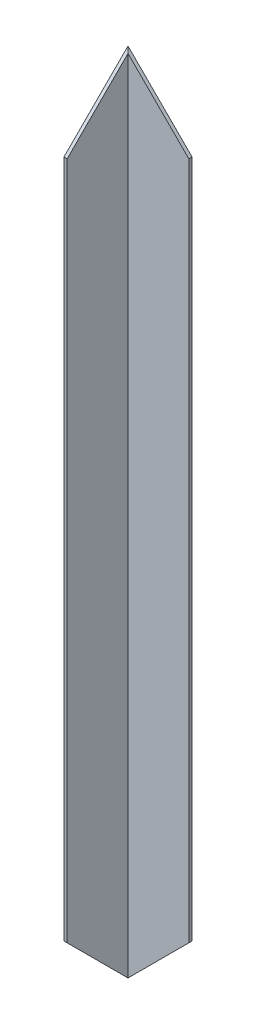
ISO-10303-21;
HEADER;
FILE_DESCRIPTION(('STEP AP214'),'2;1');
FILE_NAME('part.step','',(''),(''),'','','');
FILE_SCHEMA(('AUTOMOTIVE_DESIGN { 1 0 10303 214 1 1 1 1 }'));
ENDSEC;
DATA;
#1=APPLICATION_CONTEXT('core data for automotive mechanical design processes');
#2=APPLICATION_PROTOCOL_DEFINITION('international standard','automotive_design',2000,#1);
#3=PRODUCT_CONTEXT('',#1,'mechanical');
#4=PRODUCT('Part','Part','',(#3));
#5=PRODUCT_RELATED_PRODUCT_CATEGORY('part','',(#4));
#6=PRODUCT_DEFINITION_FORMATION('','',#4);
#7=PRODUCT_DEFINITION_CONTEXT('part definition',#1,'design');
#8=PRODUCT_DEFINITION('design','',#6,#7);
#9=PRODUCT_DEFINITION_SHAPE('','',#8);
#10=(LENGTH_UNIT() NAMED_UNIT(*) SI_UNIT(.MILLI.,.METRE.));
#11=(NAMED_UNIT(*) PLANE_ANGLE_UNIT() SI_UNIT($,.RADIAN.));
#12=(NAMED_UNIT(*) SI_UNIT($,.STERADIAN.) SOLID_ANGLE_UNIT());
#13=UNCERTAINTY_MEASURE_WITH_UNIT(LENGTH_MEASURE(1.E-05),#10,'distance_accuracy_value','');
#14=(GEOMETRIC_REPRESENTATION_CONTEXT(3) GLOBAL_UNCERTAINTY_ASSIGNED_CONTEXT((#13)) GLOBAL_UNIT_ASSIGNED_CONTEXT((#10,
#11,#12)) REPRESENTATION_CONTEXT('',''));
#15=CARTESIAN_POINT('',(0.,0.,0.));
#16=DIRECTION('',(0.,0.,1.));
#17=DIRECTION('',(1.,0.,0.));
#18=AXIS2_PLACEMENT_3D('',#15,#16,#17);
#19=CARTESIAN_POINT('',(-20.,504.,-20.1136363636364));
#20=DIRECTION('',(1.,0.,0.));
#21=DIRECTION('',(0.,0.,-1.));
#22=AXIS2_PLACEMENT_3D('',#19,#20,#21);
#23=PLANE('',#22);
#24=DIRECTION('',(0.,-1.,0.));
#25=VECTOR('',#24,1.);
#26=CARTESIAN_POINT('',(-20.,504.,19.8863636363636));
#27=LINE('',#26,#25);
#28=CARTESIAN_POINT('',(-20.,464.,19.8863636363636));
#29=VERTEX_POINT('',#28);
#30=CARTESIAN_POINT('',(-20.,39.9999999999996,19.8863636363636));
#31=VERTEX_POINT('',#30);
#32=EDGE_CURVE('E110',#29,#31,#27,.T.);
#33=ORIENTED_EDGE('',*,*,#32,.F.);
#34=DIRECTION('',(0.,-0.707106781186543,0.707106781186552));
#35=VECTOR('',#34,1.);
#36=CARTESIAN_POINT('',(-20.,504.,-20.1136363636364));
#37=LINE('',#36,#35);
#38=CARTESIAN_POINT('',(-20.,504.,-20.1136363636364));
#39=VERTEX_POINT('',#38);
#40=EDGE_CURVE('E128',#39,#29,#37,.T.);
#41=ORIENTED_EDGE('',*,*,#40,.F.);
#42=DIRECTION('',(0.,-1.,0.));
#43=VECTOR('',#42,1.);
#44=CARTESIAN_POINT('',(-20.,504.,-20.1136363636364));
#45=LINE('',#44,#43);
#46=CARTESIAN_POINT('',(-20.,0.,-20.1136363636364));
#47=VERTEX_POINT('',#46);
#48=EDGE_CURVE('E96',#39,#47,#45,.T.);
#49=ORIENTED_EDGE('',*,*,#48,.T.);
#50=DIRECTION('',(0.,-0.707106781186544,-0.707106781186551));
#51=VECTOR('',#50,1.);
#52=CARTESIAN_POINT('',(-20.,0.,-20.1136363636364));
#53=LINE('',#52,#51);
#54=EDGE_CURVE('E127',#31,#47,#53,.T.);
#55=ORIENTED_EDGE('',*,*,#54,.F.);
#56=EDGE_LOOP('',(#33,#41,#49,#55));
#57=FACE_BOUND('',#56,.T.);
#58=ADVANCED_FACE('F33',(#57),#23,.F.);
#59=CARTESIAN_POINT('',(-20.,504.,19.8863636363636));
#60=DIRECTION('',(0.,0.,-1.));
#61=DIRECTION('',(-1.,0.,0.));
#62=AXIS2_PLACEMENT_3D('',#59,#60,#61);
#63=PLANE('',#62);
#64=DIRECTION('',(0.,-1.,0.));
#65=VECTOR('',#64,1.);
#66=CARTESIAN_POINT('',(-18.,504.,19.8863636363636));
#67=LINE('',#66,#65);
#68=CARTESIAN_POINT('',(-18.,464.,19.8863636363636));
#69=VERTEX_POINT('',#68);
#70=CARTESIAN_POINT('',(-18.,39.9999999999996,19.8863636363636));
#71=VERTEX_POINT('',#70);
#72=EDGE_CURVE('E108',#69,#71,#67,.T.);
#73=ORIENTED_EDGE('',*,*,#72,.F.);
#74=DIRECTION('',(-1.,0.,0.));
#75=VECTOR('',#74,1.);
#76=CARTESIAN_POINT('',(20.,464.,19.8863636363636));
#77=LINE('',#76,#75);
#78=EDGE_CURVE('E131',#69,#29,#77,.T.);
#79=ORIENTED_EDGE('',*,*,#78,.T.);
#80=ORIENTED_EDGE('',*,*,#32,.T.);
#81=DIRECTION('',(-1.,0.,0.));
#82=VECTOR('',#81,1.);
#83=CARTESIAN_POINT('',(570.,39.9999999999996,19.8863636363635));
#84=LINE('',#83,#82);
#85=EDGE_CURVE('E140',#71,#31,#84,.T.);
#86=ORIENTED_EDGE('',*,*,#85,.F.);
#87=EDGE_LOOP('',(#73,#79,#80,#86));
#88=FACE_BOUND('',#87,.T.);
#89=ADVANCED_FACE('F154',(#88),#63,.F.);
#90=CARTESIAN_POINT('',(-18.,504.,-18.1136363636364));
#91=DIRECTION('',(-1.,0.,0.));
#92=DIRECTION('',(0.,0.,1.));
#93=AXIS2_PLACEMENT_3D('',#90,#91,#92);
#94=PLANE('',#93);
#95=DIRECTION('',(0.,-1.,0.));
#96=VECTOR('',#95,1.);
#97=CARTESIAN_POINT('',(-18.,504.,-18.1136363636364));
#98=LINE('',#97,#96);
#99=CARTESIAN_POINT('',(-18.,502.,-18.1136363636364));
#100=VERTEX_POINT('',#99);
#101=CARTESIAN_POINT('',(-18.,2.,-18.1136363636364));
#102=VERTEX_POINT('',#101);
#103=EDGE_CURVE('E101',#100,#102,#98,.T.);
#104=ORIENTED_EDGE('',*,*,#103,.F.);
#105=DIRECTION('',(0.,-0.707106781186543,0.707106781186552));
#106=VECTOR('',#105,1.);
#107=CARTESIAN_POINT('',(-18.,503.,-19.1136363636363));
#108=LINE('',#107,#106);
#109=EDGE_CURVE('E133',#100,#69,#108,.T.);
#110=ORIENTED_EDGE('',*,*,#109,.T.);
#111=ORIENTED_EDGE('',*,*,#72,.T.);
#112=DIRECTION('',(0.,-0.707106781186544,-0.707106781186551));
#113=VECTOR('',#112,1.);
#114=CARTESIAN_POINT('',(-18.,252.999999999997,232.886363636364));
#115=LINE('',#114,#113);
#116=EDGE_CURVE('E121',#71,#102,#115,.T.);
#117=ORIENTED_EDGE('',*,*,#116,.T.);
#118=EDGE_LOOP('',(#104,#110,#111,#117));
#119=FACE_BOUND('',#118,.T.);
#120=ADVANCED_FACE('F149',(#119),#94,.F.);
#121=CARTESIAN_POINT('',(-18.,504.,-18.1136363636364));
#122=DIRECTION('',(0.,0.,-1.));
#123=DIRECTION('',(-1.,0.,0.));
#124=AXIS2_PLACEMENT_3D('',#121,#122,#123);
#125=PLANE('',#124);
#126=DIRECTION('',(0.,-1.,0.));
#127=VECTOR('',#126,1.);
#128=CARTESIAN_POINT('',(20.,504.,-18.1136363636364));
#129=LINE('',#128,#127);
#130=CARTESIAN_POINT('',(20.,464.,-18.1136363636364));
#131=VERTEX_POINT('',#130);
#132=CARTESIAN_POINT('',(20.,40.0000000000001,-18.1136363636364));
#133=VERTEX_POINT('',#132);
#134=EDGE_CURVE('E47',#131,#133,#129,.T.);
#135=ORIENTED_EDGE('',*,*,#134,.F.);
#136=DIRECTION('',(-0.707106781186551,0.707106781186544,0.));
#137=VECTOR('',#136,1.);
#138=CARTESIAN_POINT('',(-19.,503.,-18.1136363636364));
#139=LINE('',#138,#137);
#140=EDGE_CURVE('E91',#131,#100,#139,.T.);
#141=ORIENTED_EDGE('',*,*,#140,.T.);
#142=ORIENTED_EDGE('',*,*,#103,.T.);
#143=DIRECTION('',(0.707106781186547,0.707106781186549,0.));
#144=VECTOR('',#143,1.);
#145=CARTESIAN_POINT('',(233.,253.000000000001,-18.1136363636364));
#146=LINE('',#145,#144);
#147=EDGE_CURVE('E103',#102,#133,#146,.T.);
#148=ORIENTED_EDGE('',*,*,#147,.T.);
#149=EDGE_LOOP('',(#135,#141,#142,#148));
#150=FACE_BOUND('',#149,.T.);
#151=ADVANCED_FACE('F145',(#150),#125,.F.);
#152=CARTESIAN_POINT('',(20.,504.,-20.1136363636364));
#153=DIRECTION('',(-1.,0.,0.));
#154=DIRECTION('',(0.,0.,1.));
#155=AXIS2_PLACEMENT_3D('',#152,#153,#154);
#156=PLANE('',#155);
#157=DIRECTION('',(0.,-1.,0.));
#158=VECTOR('',#157,1.);
#159=CARTESIAN_POINT('',(20.,504.,-20.1136363636364));
#160=LINE('',#159,#158);
#161=CARTESIAN_POINT('',(20.,464.,-20.1136363636364));
#162=VERTEX_POINT('',#161);
#163=CARTESIAN_POINT('',(20.,40.0000000000001,-20.1136363636364));
#164=VERTEX_POINT('',#163);
#165=EDGE_CURVE('E55',#162,#164,#160,.T.);
#166=ORIENTED_EDGE('',*,*,#165,.F.);
#167=DIRECTION('',(0.,0.,-1.));
#168=VECTOR('',#167,1.);
#169=CARTESIAN_POINT('',(20.,464.,19.8863636363636));
#170=LINE('',#169,#168);
#171=EDGE_CURVE('E87',#131,#162,#170,.T.);
#172=ORIENTED_EDGE('',*,*,#171,.F.);
#173=ORIENTED_EDGE('',*,*,#134,.T.);
#174=DIRECTION('',(0.,0.,-1.));
#175=VECTOR('',#174,1.);
#176=CARTESIAN_POINT('',(20.,40.0000000000001,569.886363636364));
#177=LINE('',#176,#175);
#178=EDGE_CURVE('E99',#133,#164,#177,.T.);
#179=ORIENTED_EDGE('',*,*,#178,.T.);
#180=EDGE_LOOP('',(#166,#172,#173,#179));
#181=FACE_BOUND('',#180,.T.);
#182=ADVANCED_FACE('F98',(#181),#156,.F.);
#183=CARTESIAN_POINT('',(-20.,504.,-20.1136363636364));
#184=DIRECTION('',(0.,0.,1.));
#185=DIRECTION('',(1.,0.,0.));
#186=AXIS2_PLACEMENT_3D('',#183,#184,#185);
#187=PLANE('',#186);
#188=ORIENTED_EDGE('',*,*,#48,.F.);
#189=DIRECTION('',(-0.707106781186551,0.707106781186544,0.));
#190=VECTOR('',#189,1.);
#191=CARTESIAN_POINT('',(-20.,504.,-20.1136363636364));
#192=LINE('',#191,#190);
#193=EDGE_CURVE('E89',#162,#39,#192,.T.);
#194=ORIENTED_EDGE('',*,*,#193,.F.);
#195=ORIENTED_EDGE('',*,*,#165,.T.);
#196=DIRECTION('',(0.707106781186546,0.707106781186548,0.));
#197=VECTOR('',#196,1.);
#198=CARTESIAN_POINT('',(-20.,0.,-20.1136363636364));
#199=LINE('',#198,#197);
#200=EDGE_CURVE('E116',#47,#164,#199,.T.);
#201=ORIENTED_EDGE('',*,*,#200,.F.);
#202=EDGE_LOOP('',(#188,#194,#195,#201));
#203=FACE_BOUND('',#202,.T.);
#204=ADVANCED_FACE('F94',(#203),#187,.F.);
#205=CARTESIAN_POINT('',(-20.,0.,569.886363636364));
#206=DIRECTION('',(-0.707106781186549,0.707106781186547,0.));
#207=DIRECTION('',(-0.707106781186547,-0.707106781186549,0.));
#208=AXIS2_PLACEMENT_3D('',#205,#206,#207);
#209=PLANE('',#208);
#210=ORIENTED_EDGE('',*,*,#147,.F.);
#211=DIRECTION('',(-0.577350269189623,-0.577350269189624,-0.57735026918963));
#212=VECTOR('',#211,1.);
#213=CARTESIAN_POINT('',(176.666666666667,196.666666666668,176.553030303033));
#214=LINE('',#213,#212);
#215=EDGE_CURVE('E40',#102,#47,#214,.T.);
#216=ORIENTED_EDGE('',*,*,#215,.T.);
#217=ORIENTED_EDGE('',*,*,#200,.T.);
#218=ORIENTED_EDGE('',*,*,#178,.F.);
#219=EDGE_LOOP('',(#210,#216,#217,#218));
#220=FACE_BOUND('',#219,.T.);
#221=ADVANCED_FACE('F115',(#220),#209,.F.);
#222=CARTESIAN_POINT('',(570.,0.,-20.1136363636365));
#223=DIRECTION('',(0.,0.707106781186551,-0.707106781186544));
#224=DIRECTION('',(0.,0.707106781186544,0.707106781186551));
#225=AXIS2_PLACEMENT_3D('',#222,#223,#224);
#226=PLANE('',#225);
#227=ORIENTED_EDGE('',*,*,#85,.T.);
#228=ORIENTED_EDGE('',*,*,#54,.T.);
#229=ORIENTED_EDGE('',*,*,#215,.F.);
#230=ORIENTED_EDGE('',*,*,#116,.F.);
#231=EDGE_LOOP('',(#227,#228,#229,#230));
#232=FACE_BOUND('',#231,.T.);
#233=ADVANCED_FACE('F152',(#232),#226,.F.);
#234=CARTESIAN_POINT('',(20.,504.,-20.1136363636364));
#235=DIRECTION('',(0.,-0.707106781186552,-0.707106781186543));
#236=DIRECTION('',(0.,0.707106781186543,-0.707106781186552));
#237=AXIS2_PLACEMENT_3D('',#234,#235,#236);
#238=PLANE('',#237);
#239=ORIENTED_EDGE('',*,*,#109,.F.);
#240=DIRECTION('',(-0.577350269189628,0.577350269189622,-0.577350269189628));
#241=VECTOR('',#240,1.);
#242=CARTESIAN_POINT('',(-6.6666666666666,490.666666666667,-6.78030303030293));
#243=LINE('',#242,#241);
#244=EDGE_CURVE('E11',#100,#39,#243,.T.);
#245=ORIENTED_EDGE('',*,*,#244,.T.);
#246=ORIENTED_EDGE('',*,*,#40,.T.);
#247=ORIENTED_EDGE('',*,*,#78,.F.);
#248=EDGE_LOOP('',(#239,#245,#246,#247));
#249=FACE_BOUND('',#248,.T.);
#250=ADVANCED_FACE('F155',(#249),#238,.F.);
#251=CARTESIAN_POINT('',(-20.,504.,19.8863636363636));
#252=DIRECTION('',(-0.707106781186544,-0.707106781186551,0.));
#253=DIRECTION('',(0.707106781186551,-0.707106781186544,0.));
#254=AXIS2_PLACEMENT_3D('',#251,#252,#253);
#255=PLANE('',#254);
#256=ORIENTED_EDGE('',*,*,#171,.T.);
#257=ORIENTED_EDGE('',*,*,#193,.T.);
#258=ORIENTED_EDGE('',*,*,#244,.F.);
#259=ORIENTED_EDGE('',*,*,#140,.F.);
#260=EDGE_LOOP('',(#256,#257,#258,#259));
#261=FACE_BOUND('',#260,.T.);
#262=ADVANCED_FACE('F88',(#261),#255,.F.);
#263=CLOSED_SHELL('',(#58,#89,#120,#151,#182,#204,#221,#233,#250,#262));
#264=MANIFOLD_SOLID_BREP('B2',#263);
#265=ADVANCED_BREP_SHAPE_REPRESENTATION('',(#18,#264),#14);
#266=SHAPE_DEFINITION_REPRESENTATION(#9,#265);
ENDSEC;
END-ISO-10303-21;
